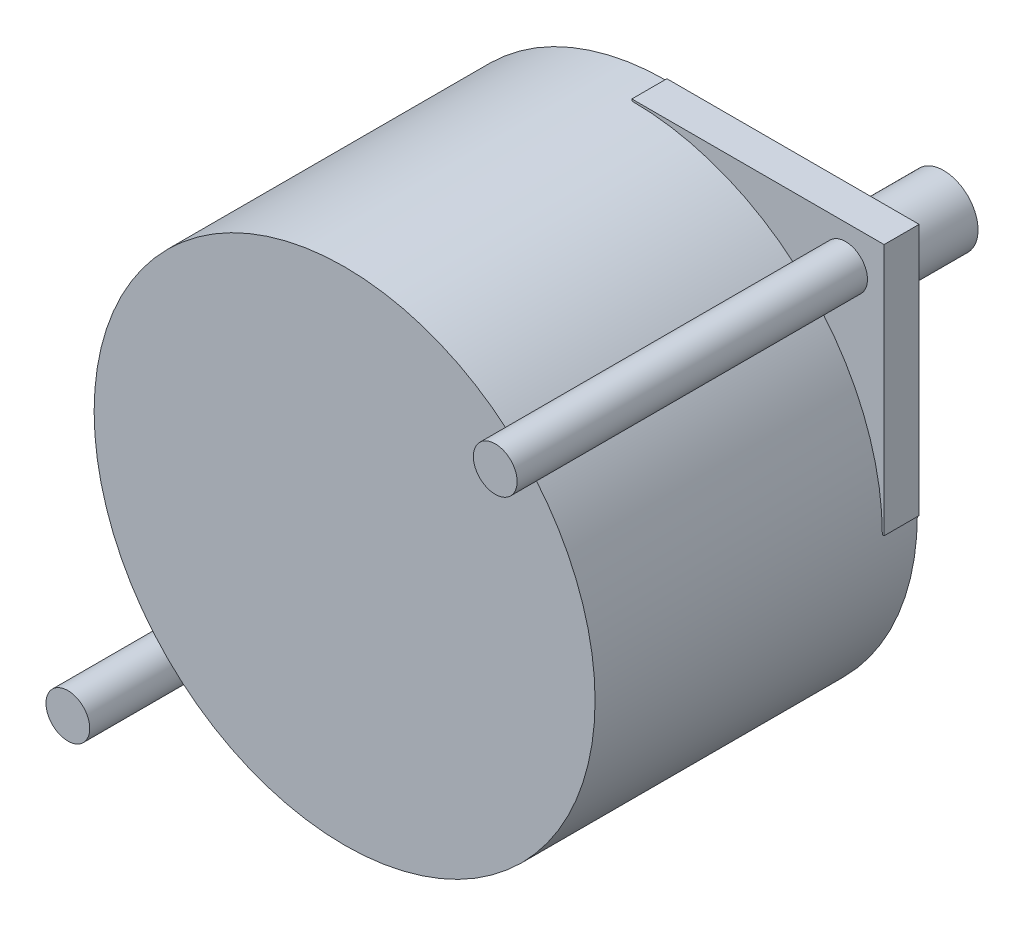
ISO-10303-21;
HEADER;
FILE_DESCRIPTION(('STEP AP214'),'2;1');
FILE_NAME('part.step','',(''),(''),'','','');
FILE_SCHEMA(('AUTOMOTIVE_DESIGN { 1 0 10303 214 1 1 1 1 }'));
ENDSEC;
DATA;
#1=APPLICATION_CONTEXT('core data for automotive mechanical design processes');
#2=APPLICATION_PROTOCOL_DEFINITION('international standard','automotive_design',2000,#1);
#3=PRODUCT_CONTEXT('',#1,'mechanical');
#4=PRODUCT('Part','Part','',(#3));
#5=PRODUCT_RELATED_PRODUCT_CATEGORY('part','',(#4));
#6=PRODUCT_DEFINITION_FORMATION('','',#4);
#7=PRODUCT_DEFINITION_CONTEXT('part definition',#1,'design');
#8=PRODUCT_DEFINITION('design','',#6,#7);
#9=PRODUCT_DEFINITION_SHAPE('','',#8);
#10=(LENGTH_UNIT() NAMED_UNIT(*) SI_UNIT(.MILLI.,.METRE.));
#11=(NAMED_UNIT(*) PLANE_ANGLE_UNIT() SI_UNIT($,.RADIAN.));
#12=(NAMED_UNIT(*) SI_UNIT($,.STERADIAN.) SOLID_ANGLE_UNIT());
#13=UNCERTAINTY_MEASURE_WITH_UNIT(LENGTH_MEASURE(1.E-05),#10,'distance_accuracy_value','');
#14=(GEOMETRIC_REPRESENTATION_CONTEXT(3) GLOBAL_UNCERTAINTY_ASSIGNED_CONTEXT((#13)) GLOBAL_UNIT_ASSIGNED_CONTEXT((#10,
#11,#12)) REPRESENTATION_CONTEXT('',''));
#15=CARTESIAN_POINT('',(0.,0.,0.));
#16=DIRECTION('',(0.,0.,1.));
#17=DIRECTION('',(1.,0.,0.));
#18=AXIS2_PLACEMENT_3D('',#15,#16,#17);
#19=CARTESIAN_POINT('',(0.,0.,2.54));
#20=DIRECTION('',(0.,0.,1.));
#21=DIRECTION('',(1.,0.,0.));
#22=AXIS2_PLACEMENT_3D('',#19,#20,#21);
#23=PLANE('',#22);
#24=CARTESIAN_POINT('',(2.15591616766473,-32.8378083832335,2.54));
#25=DIRECTION('',(0.,0.,1.));
#26=DIRECTION('',(1.,0.,0.));
#27=AXIS2_PLACEMENT_3D('',#24,#25,#26);
#28=CIRCLE('',#27,1.5875);
#29=CARTESIAN_POINT('',(3.74341616766473,-32.8378083832335,2.54));
#30=VERTEX_POINT('',#29);
#31=EDGE_CURVE('E167',#30,#30,#28,.T.);
#32=ORIENTED_EDGE('',*,*,#31,.F.);
#33=EDGE_LOOP('',(#32));
#34=FACE_BOUND('',#33,.T.);
#35=DIRECTION('',(0.,-1.,0.));
#36=VECTOR('',#35,1.);
#37=CARTESIAN_POINT('',(17.6499161676647,-35.6318083832335,2.54));
#38=LINE('',#37,#36);
#39=CARTESIAN_POINT('',(17.6499161676647,-35.5048083832335,2.54));
#40=VERTEX_POINT('',#39);
#41=CARTESIAN_POINT('',(17.6499161676647,-35.6318083832335,2.54));
#42=VERTEX_POINT('',#41);
#43=EDGE_CURVE('E134',#40,#42,#38,.T.);
#44=ORIENTED_EDGE('',*,*,#43,.F.);
#45=CARTESIAN_POINT('',(17.6499161676647,-17.3438083832335,2.54));
#46=DIRECTION('',(0.,0.,1.));
#47=DIRECTION('',(1.,0.,0.));
#48=AXIS2_PLACEMENT_3D('',#45,#46,#47);
#49=CIRCLE('',#48,18.161);
#50=CARTESIAN_POINT('',(-0.511083832335335,-17.3438083832335,2.54));
#51=VERTEX_POINT('',#50);
#52=EDGE_CURVE('E122',#51,#40,#49,.T.);
#53=ORIENTED_EDGE('',*,*,#52,.F.);
#54=DIRECTION('',(1.,0.,0.));
#55=VECTOR('',#54,1.);
#56=CARTESIAN_POINT('',(-0.638083832335327,-17.3438083832335,2.54));
#57=LINE('',#56,#55);
#58=CARTESIAN_POINT('',(-0.638083832335327,-17.3438083832335,2.54));
#59=VERTEX_POINT('',#58);
#60=EDGE_CURVE('E149',#59,#51,#57,.T.);
#61=ORIENTED_EDGE('',*,*,#60,.F.);
#62=DIRECTION('',(0.,-1.,0.));
#63=VECTOR('',#62,1.);
#64=CARTESIAN_POINT('',(-0.638083832335329,0.944191616766467,2.54));
#65=LINE('',#64,#63);
#66=CARTESIAN_POINT('',(-0.638083832335325,-35.6318083832335,2.54));
#67=VERTEX_POINT('',#66);
#68=EDGE_CURVE('E185',#59,#67,#65,.T.);
#69=ORIENTED_EDGE('',*,*,#68,.T.);
#70=DIRECTION('',(1.,0.,0.));
#71=VECTOR('',#70,1.);
#72=CARTESIAN_POINT('',(-0.638083832335325,-35.6318083832335,2.54));
#73=LINE('',#72,#71);
#74=EDGE_CURVE('E187',#67,#42,#73,.T.);
#75=ORIENTED_EDGE('',*,*,#74,.T.);
#76=EDGE_LOOP('',(#44,#53,#61,#69,#75));
#77=FACE_BOUND('',#76,.T.);
#78=ADVANCED_FACE('F35',(#34,#77),#23,.T.);
#79=CARTESIAN_POINT('',(33.1439161676646,-1.84980838323354,2.54));
#80=DIRECTION('',(0.,0.,1.));
#81=DIRECTION('',(1.,0.,0.));
#82=AXIS2_PLACEMENT_3D('',#79,#80,#81);
#83=CIRCLE('',#82,1.5875);
#84=CARTESIAN_POINT('',(34.7314161676646,-1.84980838323354,2.54));
#85=VERTEX_POINT('',#84);
#86=EDGE_CURVE('E176',#85,#85,#83,.T.);
#87=ORIENTED_EDGE('',*,*,#86,.F.);
#88=EDGE_LOOP('',(#87));
#89=FACE_BOUND('',#88,.T.);
#90=DIRECTION('',(0.,1.,0.));
#91=VECTOR('',#90,1.);
#92=CARTESIAN_POINT('',(17.6499161676647,0.944191616766467,2.54));
#93=LINE('',#92,#91);
#94=CARTESIAN_POINT('',(17.6499161676647,0.817191616766473,2.54));
#95=VERTEX_POINT('',#94);
#96=CARTESIAN_POINT('',(17.6499161676647,0.944191616766467,2.54));
#97=VERTEX_POINT('',#96);
#98=EDGE_CURVE('E119',#95,#97,#93,.T.);
#99=ORIENTED_EDGE('',*,*,#98,.F.);
#100=CARTESIAN_POINT('',(35.8109161676647,-17.3438083832335,2.54));
#101=VERTEX_POINT('',#100);
#102=EDGE_CURVE('E113',#101,#95,#49,.T.);
#103=ORIENTED_EDGE('',*,*,#102,.F.);
#104=DIRECTION('',(-1.,0.,0.));
#105=VECTOR('',#104,1.);
#106=CARTESIAN_POINT('',(35.9379161676647,-17.3438083832335,2.54));
#107=LINE('',#106,#105);
#108=CARTESIAN_POINT('',(35.9379161676647,-17.3438083832335,2.54));
#109=VERTEX_POINT('',#108);
#110=EDGE_CURVE('E116',#109,#101,#107,.T.);
#111=ORIENTED_EDGE('',*,*,#110,.F.);
#112=DIRECTION('',(0.,1.,0.));
#113=VECTOR('',#112,1.);
#114=CARTESIAN_POINT('',(35.9379161676647,0.944191616766467,2.54));
#115=LINE('',#114,#113);
#116=CARTESIAN_POINT('',(35.9379161676647,0.944191616766467,2.54));
#117=VERTEX_POINT('',#116);
#118=EDGE_CURVE('E191',#109,#117,#115,.T.);
#119=ORIENTED_EDGE('',*,*,#118,.T.);
#120=DIRECTION('',(-1.,0.,0.));
#121=VECTOR('',#120,1.);
#122=CARTESIAN_POINT('',(-0.638083832335329,0.944191616766467,2.54));
#123=LINE('',#122,#121);
#124=EDGE_CURVE('E193',#117,#97,#123,.T.);
#125=ORIENTED_EDGE('',*,*,#124,.T.);
#126=EDGE_LOOP('',(#99,#103,#111,#119,#125));
#127=FACE_BOUND('',#126,.T.);
#128=ADVANCED_FACE('F114',(#89,#127),#23,.T.);
#129=CARTESIAN_POINT('',(17.6499161676647,-17.3438083832335,-1.016));
#130=DIRECTION('',(0.,0.,-1.));
#131=DIRECTION('',(-1.,0.,0.));
#132=AXIS2_PLACEMENT_3D('',#129,#130,#131);
#133=PLANE('',#132);
#134=CARTESIAN_POINT('',(17.6499161676647,-17.3438083832335,-1.016));
#135=DIRECTION('',(0.,0.,-1.));
#136=DIRECTION('',(-1.,0.,0.));
#137=AXIS2_PLACEMENT_3D('',#134,#135,#136);
#138=CIRCLE('',#137,8.001);
#139=CARTESIAN_POINT('',(9.64891616766467,-17.3438083832335,-1.016));
#140=VERTEX_POINT('',#139);
#141=EDGE_CURVE('E135',#140,#140,#138,.T.);
#142=ORIENTED_EDGE('',*,*,#141,.T.);
#143=EDGE_LOOP('',(#142));
#144=FACE_BOUND('',#143,.T.);
#145=CARTESIAN_POINT('',(17.6499161676647,-17.3438083832335,-1.016));
#146=DIRECTION('',(0.,0.,-1.));
#147=DIRECTION('',(-1.,0.,0.));
#148=AXIS2_PLACEMENT_3D('',#145,#146,#147);
#149=CIRCLE('',#148,2.49555);
#150=CARTESIAN_POINT('',(15.1543661676647,-17.3438083832335,-1.016));
#151=VERTEX_POINT('',#150);
#152=EDGE_CURVE('E223',#151,#151,#149,.T.);
#153=ORIENTED_EDGE('',*,*,#152,.F.);
#154=EDGE_LOOP('',(#153));
#155=FACE_BOUND('',#154,.T.);
#156=ADVANCED_FACE('F252',(#144,#155),#133,.T.);
#157=CARTESIAN_POINT('',(0.,0.,0.));
#158=DIRECTION('',(0.,0.,1.));
#159=DIRECTION('',(1.,0.,0.));
#160=AXIS2_PLACEMENT_3D('',#157,#158,#159);
#161=PLANE('',#160);
#162=CARTESIAN_POINT('',(17.6499161676647,-17.3438083832335,0.));
#163=DIRECTION('',(0.,0.,-1.));
#164=DIRECTION('',(1.,0.,0.));
#165=AXIS2_PLACEMENT_3D('',#162,#163,#164);
#166=CIRCLE('',#165,18.161);
#167=CARTESIAN_POINT('',(35.8109161676647,-17.3438083832335,0.));
#168=VERTEX_POINT('',#167);
#169=CARTESIAN_POINT('',(17.6499161676647,-35.5048083832335,0.));
#170=VERTEX_POINT('',#169);
#171=EDGE_CURVE('E50',#168,#170,#166,.T.);
#172=ORIENTED_EDGE('',*,*,#171,.T.);
#173=DIRECTION('',(0.,-1.,0.));
#174=VECTOR('',#173,1.);
#175=CARTESIAN_POINT('',(17.6499161676647,-35.6318083832335,0.));
#176=LINE('',#175,#174);
#177=CARTESIAN_POINT('',(17.6499161676647,-35.6318083832335,0.));
#178=VERTEX_POINT('',#177);
#179=EDGE_CURVE('E143',#170,#178,#176,.T.);
#180=ORIENTED_EDGE('',*,*,#179,.T.);
#181=DIRECTION('',(1.,0.,0.));
#182=VECTOR('',#181,1.);
#183=CARTESIAN_POINT('',(-0.638083832335325,-35.6318083832335,0.));
#184=LINE('',#183,#182);
#185=CARTESIAN_POINT('',(-0.638083832335325,-35.6318083832335,0.));
#186=VERTEX_POINT('',#185);
#187=EDGE_CURVE('E197',#186,#178,#184,.T.);
#188=ORIENTED_EDGE('',*,*,#187,.F.);
#189=DIRECTION('',(0.,-1.,0.));
#190=VECTOR('',#189,1.);
#191=CARTESIAN_POINT('',(-0.638083832335329,0.944191616766467,0.));
#192=LINE('',#191,#190);
#193=CARTESIAN_POINT('',(-0.638083832335327,-17.3438083832335,0.));
#194=VERTEX_POINT('',#193);
#195=EDGE_CURVE('E182',#194,#186,#192,.T.);
#196=ORIENTED_EDGE('',*,*,#195,.F.);
#197=DIRECTION('',(1.,0.,0.));
#198=VECTOR('',#197,1.);
#199=CARTESIAN_POINT('',(-0.638083832335327,-17.3438083832335,0.));
#200=LINE('',#199,#198);
#201=CARTESIAN_POINT('',(-0.511083832335335,-17.3438083832335,0.));
#202=VERTEX_POINT('',#201);
#203=EDGE_CURVE('E153',#194,#202,#200,.T.);
#204=ORIENTED_EDGE('',*,*,#203,.T.);
#205=CARTESIAN_POINT('',(17.6499161676647,-17.3438083832335,0.));
#206=DIRECTION('',(0.,0.,-1.));
#207=DIRECTION('',(1.,0.,0.));
#208=AXIS2_PLACEMENT_3D('',#205,#206,#207);
#209=CIRCLE('',#208,18.161);
#210=CARTESIAN_POINT('',(17.6499161676647,0.817191616766473,0.));
#211=VERTEX_POINT('',#210);
#212=EDGE_CURVE('E57',#202,#211,#209,.T.);
#213=ORIENTED_EDGE('',*,*,#212,.T.);
#214=DIRECTION('',(0.,1.,0.));
#215=VECTOR('',#214,1.);
#216=CARTESIAN_POINT('',(17.6499161676647,0.944191616766467,0.));
#217=LINE('',#216,#215);
#218=CARTESIAN_POINT('',(17.6499161676647,0.944191616766467,0.));
#219=VERTEX_POINT('',#218);
#220=EDGE_CURVE('E157',#211,#219,#217,.T.);
#221=ORIENTED_EDGE('',*,*,#220,.T.);
#222=DIRECTION('',(-1.,0.,0.));
#223=VECTOR('',#222,1.);
#224=CARTESIAN_POINT('',(-0.638083832335329,0.944191616766467,0.));
#225=LINE('',#224,#223);
#226=CARTESIAN_POINT('',(35.9379161676647,0.944191616766467,0.));
#227=VERTEX_POINT('',#226);
#228=EDGE_CURVE('E188',#227,#219,#225,.T.);
#229=ORIENTED_EDGE('',*,*,#228,.F.);
#230=DIRECTION('',(0.,1.,0.));
#231=VECTOR('',#230,1.);
#232=CARTESIAN_POINT('',(35.9379161676647,0.944191616766467,0.));
#233=LINE('',#232,#231);
#234=CARTESIAN_POINT('',(35.9379161676647,-17.3438083832335,0.));
#235=VERTEX_POINT('',#234);
#236=EDGE_CURVE('E200',#235,#227,#233,.T.);
#237=ORIENTED_EDGE('',*,*,#236,.F.);
#238=DIRECTION('',(-1.,0.,0.));
#239=VECTOR('',#238,1.);
#240=CARTESIAN_POINT('',(35.9379161676647,-17.3438083832335,0.));
#241=LINE('',#240,#239);
#242=EDGE_CURVE('E137',#235,#168,#241,.T.);
#243=ORIENTED_EDGE('',*,*,#242,.T.);
#244=EDGE_LOOP('',(#172,#180,#188,#196,#204,#213,#221,#229,#237,#243));
#245=FACE_BOUND('',#244,.T.);
#246=CARTESIAN_POINT('',(17.6499161676647,-17.3438083832335,0.));
#247=DIRECTION('',(0.,0.,1.));
#248=DIRECTION('',(1.,0.,0.));
#249=AXIS2_PLACEMENT_3D('',#246,#247,#248);
#250=CIRCLE('',#249,8.001);
#251=CARTESIAN_POINT('',(25.6509161676647,-17.3438083832335,0.));
#252=VERTEX_POINT('',#251);
#253=EDGE_CURVE('E11',#252,#252,#250,.F.);
#254=ORIENTED_EDGE('',*,*,#253,.F.);
#255=EDGE_LOOP('',(#254));
#256=FACE_BOUND('',#255,.T.);
#257=ADVANCED_FACE('F217',(#245,#256),#161,.F.);
#258=CARTESIAN_POINT('',(-0.638083832335329,0.944191616766467,2.54));
#259=DIRECTION('',(1.,0.,0.));
#260=DIRECTION('',(0.,1.,0.));
#261=AXIS2_PLACEMENT_3D('',#258,#259,#260);
#262=PLANE('',#261);
#263=ORIENTED_EDGE('',*,*,#68,.F.);
#264=DIRECTION('',(0.,0.,1.));
#265=VECTOR('',#264,1.);
#266=CARTESIAN_POINT('',(-0.638083832335327,-17.3438083832335,0.));
#267=LINE('',#266,#265);
#268=EDGE_CURVE('E160',#194,#59,#267,.T.);
#269=ORIENTED_EDGE('',*,*,#268,.F.);
#270=ORIENTED_EDGE('',*,*,#195,.T.);
#271=DIRECTION('',(0.,0.,-1.));
#272=VECTOR('',#271,1.);
#273=CARTESIAN_POINT('',(-0.638083832335325,-35.6318083832335,2.54));
#274=LINE('',#273,#272);
#275=EDGE_CURVE('E43',#67,#186,#274,.T.);
#276=ORIENTED_EDGE('',*,*,#275,.F.);
#277=EDGE_LOOP('',(#263,#269,#270,#276));
#278=FACE_BOUND('',#277,.T.);
#279=ADVANCED_FACE('F37',(#278),#262,.F.);
#280=CARTESIAN_POINT('',(-0.638083832335325,-35.6318083832335,2.54));
#281=DIRECTION('',(0.,1.,0.));
#282=DIRECTION('',(0.,0.,1.));
#283=AXIS2_PLACEMENT_3D('',#280,#281,#282);
#284=PLANE('',#283);
#285=ORIENTED_EDGE('',*,*,#187,.T.);
#286=DIRECTION('',(0.,0.,1.));
#287=VECTOR('',#286,1.);
#288=CARTESIAN_POINT('',(17.6499161676647,-35.6318083832335,0.));
#289=LINE('',#288,#287);
#290=EDGE_CURVE('E146',#178,#42,#289,.T.);
#291=ORIENTED_EDGE('',*,*,#290,.T.);
#292=ORIENTED_EDGE('',*,*,#74,.F.);
#293=ORIENTED_EDGE('',*,*,#275,.T.);
#294=EDGE_LOOP('',(#285,#291,#292,#293));
#295=FACE_BOUND('',#294,.T.);
#296=ADVANCED_FACE('F209',(#295),#284,.F.);
#297=CARTESIAN_POINT('',(35.9379161676647,0.944191616766467,2.54));
#298=DIRECTION('',(-1.,0.,0.));
#299=DIRECTION('',(0.,-1.,0.));
#300=AXIS2_PLACEMENT_3D('',#297,#298,#299);
#301=PLANE('',#300);
#302=ORIENTED_EDGE('',*,*,#118,.F.);
#303=DIRECTION('',(0.,0.,1.));
#304=VECTOR('',#303,1.);
#305=CARTESIAN_POINT('',(35.9379161676647,-17.3438083832335,0.));
#306=LINE('',#305,#304);
#307=EDGE_CURVE('E130',#235,#109,#306,.T.);
#308=ORIENTED_EDGE('',*,*,#307,.F.);
#309=ORIENTED_EDGE('',*,*,#236,.T.);
#310=DIRECTION('',(0.,0.,-1.));
#311=VECTOR('',#310,1.);
#312=CARTESIAN_POINT('',(35.9379161676647,0.944191616766467,2.54));
#313=LINE('',#312,#311);
#314=EDGE_CURVE('E195',#117,#227,#313,.T.);
#315=ORIENTED_EDGE('',*,*,#314,.F.);
#316=EDGE_LOOP('',(#302,#308,#309,#315));
#317=FACE_BOUND('',#316,.T.);
#318=ADVANCED_FACE('F265',(#317),#301,.F.);
#319=CARTESIAN_POINT('',(-0.638083832335329,0.944191616766467,2.54));
#320=DIRECTION('',(0.,-1.,0.));
#321=DIRECTION('',(0.,0.,-1.));
#322=AXIS2_PLACEMENT_3D('',#319,#320,#321);
#323=PLANE('',#322);
#324=ORIENTED_EDGE('',*,*,#228,.T.);
#325=DIRECTION('',(0.,0.,1.));
#326=VECTOR('',#325,1.);
#327=CARTESIAN_POINT('',(17.6499161676647,0.944191616766467,0.));
#328=LINE('',#327,#326);
#329=EDGE_CURVE('E164',#219,#97,#328,.T.);
#330=ORIENTED_EDGE('',*,*,#329,.T.);
#331=ORIENTED_EDGE('',*,*,#124,.F.);
#332=ORIENTED_EDGE('',*,*,#314,.T.);
#333=EDGE_LOOP('',(#324,#330,#331,#332));
#334=FACE_BOUND('',#333,.T.);
#335=ADVANCED_FACE('F262',(#334),#323,.F.);
#336=CARTESIAN_POINT('',(33.1439161676646,-1.84980838323354,27.94));
#337=DIRECTION('',(0.,0.,-1.));
#338=DIRECTION('',(-1.,0.,0.));
#339=AXIS2_PLACEMENT_3D('',#336,#337,#338);
#340=CYLINDRICAL_SURFACE('',#339,1.5875);
#341=CARTESIAN_POINT('',(33.1439161676646,-1.84980838323354,27.94));
#342=DIRECTION('',(0.,0.,1.));
#343=DIRECTION('',(1.,0.,0.));
#344=AXIS2_PLACEMENT_3D('',#341,#342,#343);
#345=CIRCLE('',#344,1.5875);
#346=CARTESIAN_POINT('',(34.7314161676646,-1.84980838323354,27.94));
#347=VERTEX_POINT('',#346);
#348=EDGE_CURVE('E179',#347,#347,#345,.T.);
#349=ORIENTED_EDGE('',*,*,#348,.F.);
#350=EDGE_LOOP('',(#349));
#351=FACE_BOUND('',#350,.T.);
#352=ORIENTED_EDGE('',*,*,#86,.T.);
#353=EDGE_LOOP('',(#352));
#354=FACE_BOUND('',#353,.T.);
#355=ADVANCED_FACE('F258',(#351,#354),#340,.T.);
#356=CARTESIAN_POINT('',(33.1439161676646,-1.84980838323354,27.94));
#357=DIRECTION('',(0.,0.,1.));
#358=DIRECTION('',(1.,0.,0.));
#359=AXIS2_PLACEMENT_3D('',#356,#357,#358);
#360=PLANE('',#359);
#361=ORIENTED_EDGE('',*,*,#348,.T.);
#362=EDGE_LOOP('',(#361));
#363=FACE_BOUND('',#362,.T.);
#364=ADVANCED_FACE('F405',(#363),#360,.T.);
#365=CARTESIAN_POINT('',(2.15591616766473,-32.8378083832335,27.94));
#366=DIRECTION('',(0.,0.,-1.));
#367=DIRECTION('',(-1.,0.,0.));
#368=AXIS2_PLACEMENT_3D('',#365,#366,#367);
#369=CYLINDRICAL_SURFACE('',#368,1.5875);
#370=CARTESIAN_POINT('',(2.15591616766473,-32.8378083832335,27.94));
#371=DIRECTION('',(0.,0.,1.));
#372=DIRECTION('',(1.,0.,0.));
#373=AXIS2_PLACEMENT_3D('',#370,#371,#372);
#374=CIRCLE('',#373,1.5875);
#375=CARTESIAN_POINT('',(3.74341616766473,-32.8378083832335,27.94));
#376=VERTEX_POINT('',#375);
#377=EDGE_CURVE('E173',#376,#376,#374,.T.);
#378=ORIENTED_EDGE('',*,*,#377,.F.);
#379=EDGE_LOOP('',(#378));
#380=FACE_BOUND('',#379,.T.);
#381=ORIENTED_EDGE('',*,*,#31,.T.);
#382=EDGE_LOOP('',(#381));
#383=FACE_BOUND('',#382,.T.);
#384=ADVANCED_FACE('F398',(#380,#383),#369,.T.);
#385=CARTESIAN_POINT('',(2.15591616766473,-32.8378083832335,27.94));
#386=DIRECTION('',(0.,0.,1.));
#387=DIRECTION('',(1.,0.,0.));
#388=AXIS2_PLACEMENT_3D('',#385,#386,#387);
#389=PLANE('',#388);
#390=ORIENTED_EDGE('',*,*,#377,.T.);
#391=EDGE_LOOP('',(#390));
#392=FACE_BOUND('',#391,.T.);
#393=ADVANCED_FACE('F243',(#392),#389,.T.);
#394=CARTESIAN_POINT('',(17.6499161676647,0.944191616766467,0.));
#395=DIRECTION('',(1.,0.,0.));
#396=DIRECTION('',(0.,0.,-1.));
#397=AXIS2_PLACEMENT_3D('',#394,#395,#396);
#398=PLANE('',#397);
#399=ORIENTED_EDGE('',*,*,#98,.T.);
#400=ORIENTED_EDGE('',*,*,#329,.F.);
#401=ORIENTED_EDGE('',*,*,#220,.F.);
#402=DIRECTION('',(0.,0.,1.));
#403=VECTOR('',#402,1.);
#404=CARTESIAN_POINT('',(17.6499161676647,0.817191616766473,0.));
#405=LINE('',#404,#403);
#406=EDGE_CURVE('E168',#211,#95,#405,.T.);
#407=ORIENTED_EDGE('',*,*,#406,.T.);
#408=EDGE_LOOP('',(#399,#400,#401,#407));
#409=FACE_BOUND('',#408,.T.);
#410=ADVANCED_FACE('F234',(#409),#398,.F.);
#411=CARTESIAN_POINT('',(17.6499161676647,-17.3438083832335,0.));
#412=DIRECTION('',(0.,0.,1.));
#413=DIRECTION('',(1.,0.,0.));
#414=AXIS2_PLACEMENT_3D('',#411,#412,#413);
#415=CYLINDRICAL_SURFACE('',#414,18.161);
#416=DIRECTION('',(0.,0.,1.));
#417=VECTOR('',#416,1.);
#418=CARTESIAN_POINT('',(-0.511083832335335,-17.3438083832335,0.));
#419=LINE('',#418,#417);
#420=EDGE_CURVE('E170',#202,#51,#419,.T.);
#421=ORIENTED_EDGE('',*,*,#420,.T.);
#422=ORIENTED_EDGE('',*,*,#52,.T.);
#423=DIRECTION('',(0.,0.,1.));
#424=VECTOR('',#423,1.);
#425=CARTESIAN_POINT('',(17.6499161676647,-35.5048083832335,0.));
#426=LINE('',#425,#424);
#427=EDGE_CURVE('E129',#170,#40,#426,.T.);
#428=ORIENTED_EDGE('',*,*,#427,.F.);
#429=ORIENTED_EDGE('',*,*,#171,.F.);
#430=DIRECTION('',(0.,0.,1.));
#431=VECTOR('',#430,1.);
#432=CARTESIAN_POINT('',(35.8109161676647,-17.3438083832335,0.));
#433=LINE('',#432,#431);
#434=EDGE_CURVE('E124',#168,#101,#433,.T.);
#435=ORIENTED_EDGE('',*,*,#434,.T.);
#436=ORIENTED_EDGE('',*,*,#102,.T.);
#437=ORIENTED_EDGE('',*,*,#406,.F.);
#438=ORIENTED_EDGE('',*,*,#212,.F.);
#439=EDGE_LOOP('',(#421,#422,#428,#429,#435,#436,#437,#438));
#440=FACE_BOUND('',#439,.T.);
#441=CARTESIAN_POINT('',(17.6499161676647,-17.3438083832335,23.368));
#442=DIRECTION('',(0.,0.,1.));
#443=DIRECTION('',(1.,0.,0.));
#444=AXIS2_PLACEMENT_3D('',#441,#442,#443);
#445=CIRCLE('',#444,18.161);
#446=CARTESIAN_POINT('',(35.8109161676647,-17.3438083832335,23.368));
#447=VERTEX_POINT('',#446);
#448=EDGE_CURVE('E121',#447,#447,#445,.T.);
#449=ORIENTED_EDGE('',*,*,#448,.F.);
#450=EDGE_LOOP('',(#449));
#451=FACE_BOUND('',#450,.T.);
#452=ADVANCED_FACE('F125',(#440,#451),#415,.T.);
#453=CARTESIAN_POINT('',(-0.638083832335327,-17.3438083832335,0.));
#454=DIRECTION('',(0.,-1.,0.));
#455=DIRECTION('',(0.,0.,-1.));
#456=AXIS2_PLACEMENT_3D('',#453,#454,#455);
#457=PLANE('',#456);
#458=ORIENTED_EDGE('',*,*,#60,.T.);
#459=ORIENTED_EDGE('',*,*,#420,.F.);
#460=ORIENTED_EDGE('',*,*,#203,.F.);
#461=ORIENTED_EDGE('',*,*,#268,.T.);
#462=EDGE_LOOP('',(#458,#459,#460,#461));
#463=FACE_BOUND('',#462,.T.);
#464=ADVANCED_FACE('F233',(#463),#457,.F.);
#465=CARTESIAN_POINT('',(17.6499161676647,-35.6318083832335,0.));
#466=DIRECTION('',(-1.,0.,0.));
#467=DIRECTION('',(0.,-1.,0.));
#468=AXIS2_PLACEMENT_3D('',#465,#466,#467);
#469=PLANE('',#468);
#470=ORIENTED_EDGE('',*,*,#43,.T.);
#471=ORIENTED_EDGE('',*,*,#290,.F.);
#472=ORIENTED_EDGE('',*,*,#179,.F.);
#473=ORIENTED_EDGE('',*,*,#427,.T.);
#474=EDGE_LOOP('',(#470,#471,#472,#473));
#475=FACE_BOUND('',#474,.T.);
#476=ADVANCED_FACE('F240',(#475),#469,.F.);
#477=CARTESIAN_POINT('',(35.9379161676647,-17.3438083832335,0.));
#478=DIRECTION('',(0.,1.,0.));
#479=DIRECTION('',(0.,0.,1.));
#480=AXIS2_PLACEMENT_3D('',#477,#478,#479);
#481=PLANE('',#480);
#482=ORIENTED_EDGE('',*,*,#110,.T.);
#483=ORIENTED_EDGE('',*,*,#434,.F.);
#484=ORIENTED_EDGE('',*,*,#242,.F.);
#485=ORIENTED_EDGE('',*,*,#307,.T.);
#486=EDGE_LOOP('',(#482,#483,#484,#485));
#487=FACE_BOUND('',#486,.T.);
#488=ADVANCED_FACE('F132',(#487),#481,.F.);
#489=CARTESIAN_POINT('',(17.6499161676647,-17.3438083832335,-1.016));
#490=DIRECTION('',(0.,0.,1.));
#491=DIRECTION('',(1.,0.,0.));
#492=AXIS2_PLACEMENT_3D('',#489,#490,#491);
#493=CYLINDRICAL_SURFACE('',#492,8.001);
#494=ORIENTED_EDGE('',*,*,#141,.F.);
#495=EDGE_LOOP('',(#494));
#496=FACE_BOUND('',#495,.T.);
#497=ORIENTED_EDGE('',*,*,#253,.T.);
#498=EDGE_LOOP('',(#497));
#499=FACE_BOUND('',#498,.T.);
#500=ADVANCED_FACE('F336',(#496,#499),#493,.T.);
#501=CARTESIAN_POINT('',(17.6499161676647,-17.3438083832335,-20.066));
#502=DIRECTION('',(0.,0.,1.));
#503=DIRECTION('',(1.,0.,0.));
#504=AXIS2_PLACEMENT_3D('',#501,#502,#503);
#505=CYLINDRICAL_SURFACE('',#504,2.49555);
#506=CARTESIAN_POINT('',(17.6499161676647,-17.3438083832335,-20.066));
#507=DIRECTION('',(0.,0.,-1.));
#508=DIRECTION('',(-1.,0.,0.));
#509=AXIS2_PLACEMENT_3D('',#506,#507,#508);
#510=CIRCLE('',#509,2.49555);
#511=CARTESIAN_POINT('',(15.1543661676647,-17.3438083832335,-20.066));
#512=VERTEX_POINT('',#511);
#513=EDGE_CURVE('E140',#512,#512,#510,.T.);
#514=ORIENTED_EDGE('',*,*,#513,.F.);
#515=EDGE_LOOP('',(#514));
#516=FACE_BOUND('',#515,.T.);
#517=ORIENTED_EDGE('',*,*,#152,.T.);
#518=EDGE_LOOP('',(#517));
#519=FACE_BOUND('',#518,.T.);
#520=ADVANCED_FACE('F352',(#516,#519),#505,.T.);
#521=CARTESIAN_POINT('',(17.6499161676647,-17.3438083832335,-20.066));
#522=DIRECTION('',(0.,0.,-1.));
#523=DIRECTION('',(-1.,0.,0.));
#524=AXIS2_PLACEMENT_3D('',#521,#522,#523);
#525=PLANE('',#524);
#526=ORIENTED_EDGE('',*,*,#513,.T.);
#527=EDGE_LOOP('',(#526));
#528=FACE_BOUND('',#527,.T.);
#529=ADVANCED_FACE('F344',(#528),#525,.T.);
#530=CARTESIAN_POINT('',(17.6499161676647,-17.3438083832335,23.368));
#531=DIRECTION('',(0.,0.,1.));
#532=DIRECTION('',(1.,0.,0.));
#533=AXIS2_PLACEMENT_3D('',#530,#531,#532);
#534=PLANE('',#533);
#535=ORIENTED_EDGE('',*,*,#448,.T.);
#536=EDGE_LOOP('',(#535));
#537=FACE_BOUND('',#536,.T.);
#538=ADVANCED_FACE('F231',(#537),#534,.T.);
#539=CLOSED_SHELL('',(#78,#128,#156,#257,#279,#296,#318,#335,#355,#364,#384,#393,#410,#452,#464,
#476,#488,#500,#520,#529,#538));
#540=MANIFOLD_SOLID_BREP('B2',#539);
#541=ADVANCED_BREP_SHAPE_REPRESENTATION('',(#18,#540),#14);
#542=SHAPE_DEFINITION_REPRESENTATION(#9,#541);
ENDSEC;
END-ISO-10303-21;
